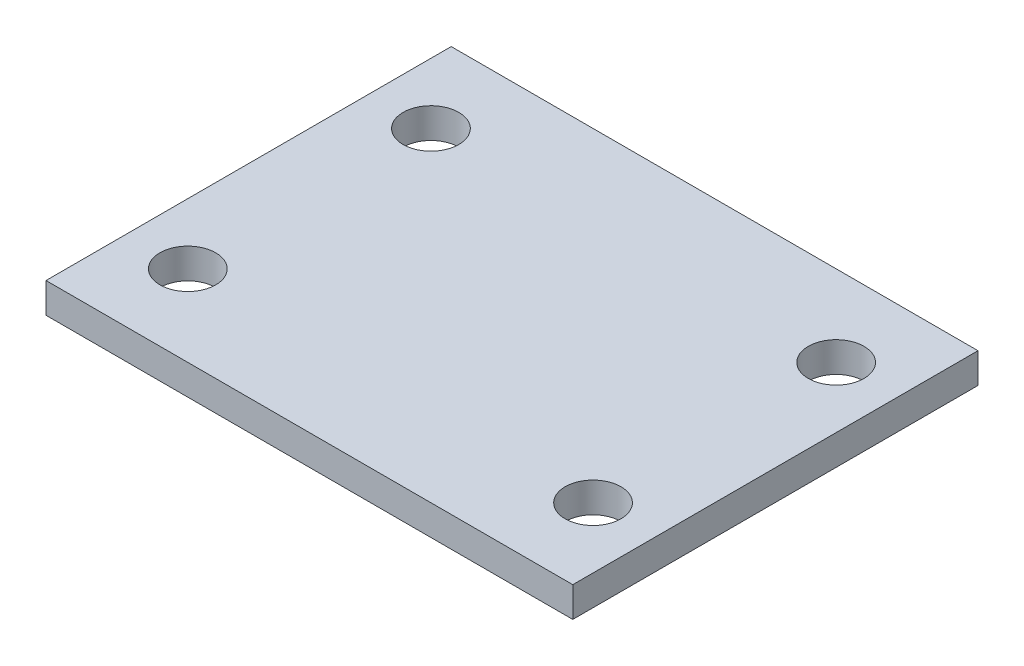
ISO-10303-21;
HEADER;
FILE_DESCRIPTION(('STEP AP214'),'2;1');
FILE_NAME('part.step','',(''),(''),'','','');
FILE_SCHEMA(('AUTOMOTIVE_DESIGN { 1 0 10303 214 1 1 1 1 }'));
ENDSEC;
DATA;
#1=APPLICATION_CONTEXT('core data for automotive mechanical design processes');
#2=APPLICATION_PROTOCOL_DEFINITION('international standard','automotive_design',2000,#1);
#3=PRODUCT_CONTEXT('',#1,'mechanical');
#4=PRODUCT('Part','Part','',(#3));
#5=PRODUCT_RELATED_PRODUCT_CATEGORY('part','',(#4));
#6=PRODUCT_DEFINITION_FORMATION('','',#4);
#7=PRODUCT_DEFINITION_CONTEXT('part definition',#1,'design');
#8=PRODUCT_DEFINITION('design','',#6,#7);
#9=PRODUCT_DEFINITION_SHAPE('','',#8);
#10=(LENGTH_UNIT() NAMED_UNIT(*) SI_UNIT(.MILLI.,.METRE.));
#11=(NAMED_UNIT(*) PLANE_ANGLE_UNIT() SI_UNIT($,.RADIAN.));
#12=(NAMED_UNIT(*) SI_UNIT($,.STERADIAN.) SOLID_ANGLE_UNIT());
#13=UNCERTAINTY_MEASURE_WITH_UNIT(LENGTH_MEASURE(1.E-05),#10,'distance_accuracy_value','');
#14=(GEOMETRIC_REPRESENTATION_CONTEXT(3) GLOBAL_UNCERTAINTY_ASSIGNED_CONTEXT((#13)) GLOBAL_UNIT_ASSIGNED_CONTEXT((#10,
#11,#12)) REPRESENTATION_CONTEXT('',''));
#15=CARTESIAN_POINT('',(0.,0.,0.));
#16=DIRECTION('',(0.,0.,1.));
#17=DIRECTION('',(1.,0.,0.));
#18=AXIS2_PLACEMENT_3D('',#15,#16,#17);
#19=CARTESIAN_POINT('',(25.999999943,2.97434,-20.000000005));
#20=DIRECTION('',(-1.,0.,0.));
#21=DIRECTION('',(0.,0.,1.));
#22=AXIS2_PLACEMENT_3D('',#19,#20,#21);
#23=PLANE('',#22);
#24=DIRECTION('',(0.,0.,-1.));
#25=VECTOR('',#24,1.);
#26=CARTESIAN_POINT('',(25.999999943,0.,-20.000000005));
#27=LINE('',#26,#25);
#28=CARTESIAN_POINT('',(25.999999943,0.,20.000000005));
#29=VERTEX_POINT('',#28);
#30=CARTESIAN_POINT('',(25.999999943,0.,-20.000000005));
#31=VERTEX_POINT('',#30);
#32=EDGE_CURVE('E97',#29,#31,#27,.T.);
#33=ORIENTED_EDGE('',*,*,#32,.T.);
#34=DIRECTION('',(0.,-1.,0.));
#35=VECTOR('',#34,1.);
#36=CARTESIAN_POINT('',(25.999999943,2.97434,-20.000000005));
#37=LINE('',#36,#35);
#38=CARTESIAN_POINT('',(25.999999943,2.97434,-20.000000005));
#39=VERTEX_POINT('',#38);
#40=EDGE_CURVE('E11',#39,#31,#37,.T.);
#41=ORIENTED_EDGE('',*,*,#40,.F.);
#42=DIRECTION('',(0.,0.,-1.));
#43=VECTOR('',#42,1.);
#44=CARTESIAN_POINT('',(25.999999943,2.97434,-20.000000005));
#45=LINE('',#44,#43);
#46=CARTESIAN_POINT('',(25.999999943,2.97434,20.000000005));
#47=VERTEX_POINT('',#46);
#48=EDGE_CURVE('E85',#47,#39,#45,.T.);
#49=ORIENTED_EDGE('',*,*,#48,.F.);
#50=DIRECTION('',(0.,-1.,0.));
#51=VECTOR('',#50,1.);
#52=CARTESIAN_POINT('',(25.999999943,2.97434,20.000000005));
#53=LINE('',#52,#51);
#54=EDGE_CURVE('E93',#47,#29,#53,.T.);
#55=ORIENTED_EDGE('',*,*,#54,.T.);
#56=EDGE_LOOP('',(#33,#41,#49,#55));
#57=FACE_BOUND('',#56,.T.);
#58=ADVANCED_FACE('F34',(#57),#23,.F.);
#59=CARTESIAN_POINT('',(-25.999999943,2.97434,-20.000000005));
#60=DIRECTION('',(0.,0.,1.));
#61=DIRECTION('',(1.,0.,0.));
#62=AXIS2_PLACEMENT_3D('',#59,#60,#61);
#63=PLANE('',#62);
#64=DIRECTION('',(-1.,0.,0.));
#65=VECTOR('',#64,1.);
#66=CARTESIAN_POINT('',(-25.999999943,0.,-20.000000005));
#67=LINE('',#66,#65);
#68=CARTESIAN_POINT('',(-25.999999943,0.,-20.000000005));
#69=VERTEX_POINT('',#68);
#70=EDGE_CURVE('E89',#31,#69,#67,.T.);
#71=ORIENTED_EDGE('',*,*,#70,.T.);
#72=DIRECTION('',(0.,-1.,0.));
#73=VECTOR('',#72,1.);
#74=CARTESIAN_POINT('',(-25.999999943,2.97434,-20.000000005));
#75=LINE('',#74,#73);
#76=CARTESIAN_POINT('',(-25.999999943,2.97434,-20.000000005));
#77=VERTEX_POINT('',#76);
#78=EDGE_CURVE('E42',#77,#69,#75,.T.);
#79=ORIENTED_EDGE('',*,*,#78,.F.);
#80=DIRECTION('',(-1.,0.,0.));
#81=VECTOR('',#80,1.);
#82=CARTESIAN_POINT('',(-25.999999943,2.97434,-20.000000005));
#83=LINE('',#82,#81);
#84=EDGE_CURVE('E80',#39,#77,#83,.T.);
#85=ORIENTED_EDGE('',*,*,#84,.F.);
#86=ORIENTED_EDGE('',*,*,#40,.T.);
#87=EDGE_LOOP('',(#71,#79,#85,#86));
#88=FACE_BOUND('',#87,.T.);
#89=ADVANCED_FACE('F88',(#88),#63,.F.);
#90=CARTESIAN_POINT('',(-25.999999943,2.97434,-20.000000005));
#91=DIRECTION('',(1.,0.,0.));
#92=DIRECTION('',(0.,0.,-1.));
#93=AXIS2_PLACEMENT_3D('',#90,#91,#92);
#94=PLANE('',#93);
#95=DIRECTION('',(0.,0.,1.));
#96=VECTOR('',#95,1.);
#97=CARTESIAN_POINT('',(-25.999999943,0.,-20.000000005));
#98=LINE('',#97,#96);
#99=CARTESIAN_POINT('',(-25.999999943,0.,20.000000005));
#100=VERTEX_POINT('',#99);
#101=EDGE_CURVE('E67',#69,#100,#98,.T.);
#102=ORIENTED_EDGE('',*,*,#101,.T.);
#103=DIRECTION('',(0.,-1.,0.));
#104=VECTOR('',#103,1.);
#105=CARTESIAN_POINT('',(-25.999999943,2.97434,20.000000005));
#106=LINE('',#105,#104);
#107=CARTESIAN_POINT('',(-25.999999943,2.97434,20.000000005));
#108=VERTEX_POINT('',#107);
#109=EDGE_CURVE('E90',#108,#100,#106,.T.);
#110=ORIENTED_EDGE('',*,*,#109,.F.);
#111=DIRECTION('',(0.,0.,1.));
#112=VECTOR('',#111,1.);
#113=CARTESIAN_POINT('',(-25.999999943,2.97434,-20.000000005));
#114=LINE('',#113,#112);
#115=EDGE_CURVE('E83',#77,#108,#114,.T.);
#116=ORIENTED_EDGE('',*,*,#115,.F.);
#117=ORIENTED_EDGE('',*,*,#78,.T.);
#118=EDGE_LOOP('',(#102,#110,#116,#117));
#119=FACE_BOUND('',#118,.T.);
#120=ADVANCED_FACE('F91',(#119),#94,.F.);
#121=CARTESIAN_POINT('',(-25.999999943,2.97434,20.000000005));
#122=DIRECTION('',(0.,0.,-1.));
#123=DIRECTION('',(-1.,0.,0.));
#124=AXIS2_PLACEMENT_3D('',#121,#122,#123);
#125=PLANE('',#124);
#126=DIRECTION('',(1.,0.,0.));
#127=VECTOR('',#126,1.);
#128=CARTESIAN_POINT('',(-25.999999943,0.,20.000000005));
#129=LINE('',#128,#127);
#130=EDGE_CURVE('E73',#100,#29,#129,.T.);
#131=ORIENTED_EDGE('',*,*,#130,.T.);
#132=ORIENTED_EDGE('',*,*,#54,.F.);
#133=DIRECTION('',(1.,0.,0.));
#134=VECTOR('',#133,1.);
#135=CARTESIAN_POINT('',(-25.999999943,2.97434,20.000000005));
#136=LINE('',#135,#134);
#137=EDGE_CURVE('E50',#108,#47,#136,.T.);
#138=ORIENTED_EDGE('',*,*,#137,.F.);
#139=ORIENTED_EDGE('',*,*,#109,.T.);
#140=EDGE_LOOP('',(#131,#132,#138,#139));
#141=FACE_BOUND('',#140,.T.);
#142=ADVANCED_FACE('F105',(#141),#125,.F.);
#143=CARTESIAN_POINT('',(0.,2.97434,0.));
#144=DIRECTION('',(0.,1.,0.));
#145=DIRECTION('',(0.,0.,1.));
#146=AXIS2_PLACEMENT_3D('',#143,#144,#145);
#147=PLANE('',#146);
#148=CARTESIAN_POINT('',(20.,2.97434,-12.));
#149=DIRECTION('',(0.,-1.,0.));
#150=DIRECTION('',(0.,0.,-1.));
#151=AXIS2_PLACEMENT_3D('',#148,#149,#150);
#152=CIRCLE('',#151,2.75);
#153=CARTESIAN_POINT('',(20.,2.97434,-14.75));
#154=VERTEX_POINT('',#153);
#155=EDGE_CURVE('E128',#154,#154,#152,.T.);
#156=ORIENTED_EDGE('',*,*,#155,.T.);
#157=EDGE_LOOP('',(#156));
#158=FACE_BOUND('',#157,.T.);
#159=CARTESIAN_POINT('',(-20.,2.97434,-12.));
#160=DIRECTION('',(0.,-1.,0.));
#161=DIRECTION('',(0.,0.,-1.));
#162=AXIS2_PLACEMENT_3D('',#159,#160,#161);
#163=CIRCLE('',#162,2.75);
#164=CARTESIAN_POINT('',(-20.,2.97434,-14.75));
#165=VERTEX_POINT('',#164);
#166=EDGE_CURVE('E122',#165,#165,#163,.T.);
#167=ORIENTED_EDGE('',*,*,#166,.T.);
#168=EDGE_LOOP('',(#167));
#169=FACE_BOUND('',#168,.T.);
#170=CARTESIAN_POINT('',(-20.,2.97434,12.));
#171=DIRECTION('',(0.,-1.,0.));
#172=DIRECTION('',(0.,0.,-1.));
#173=AXIS2_PLACEMENT_3D('',#170,#171,#172);
#174=CIRCLE('',#173,2.75);
#175=CARTESIAN_POINT('',(-20.,2.97434,9.25));
#176=VERTEX_POINT('',#175);
#177=EDGE_CURVE('E116',#176,#176,#174,.T.);
#178=ORIENTED_EDGE('',*,*,#177,.T.);
#179=EDGE_LOOP('',(#178));
#180=FACE_BOUND('',#179,.T.);
#181=CARTESIAN_POINT('',(20.,2.97434,12.));
#182=DIRECTION('',(0.,-1.,0.));
#183=DIRECTION('',(0.,0.,-1.));
#184=AXIS2_PLACEMENT_3D('',#181,#182,#183);
#185=CIRCLE('',#184,2.75);
#186=CARTESIAN_POINT('',(20.,2.97434,9.24999999999999));
#187=VERTEX_POINT('',#186);
#188=EDGE_CURVE('E100',#187,#187,#185,.T.);
#189=ORIENTED_EDGE('',*,*,#188,.T.);
#190=EDGE_LOOP('',(#189));
#191=FACE_BOUND('',#190,.T.);
#192=ORIENTED_EDGE('',*,*,#48,.T.);
#193=ORIENTED_EDGE('',*,*,#84,.T.);
#194=ORIENTED_EDGE('',*,*,#115,.T.);
#195=ORIENTED_EDGE('',*,*,#137,.T.);
#196=EDGE_LOOP('',(#192,#193,#194,#195));
#197=FACE_BOUND('',#196,.T.);
#198=ADVANCED_FACE('F81',(#158,#169,#180,#191,#197),#147,.T.);
#199=CARTESIAN_POINT('',(0.,0.,0.));
#200=DIRECTION('',(0.,1.,0.));
#201=DIRECTION('',(0.,0.,1.));
#202=AXIS2_PLACEMENT_3D('',#199,#200,#201);
#203=PLANE('',#202);
#204=CARTESIAN_POINT('',(20.,0.,-12.));
#205=DIRECTION('',(0.,-1.,0.));
#206=DIRECTION('',(0.,0.,-1.));
#207=AXIS2_PLACEMENT_3D('',#204,#205,#206);
#208=CIRCLE('',#207,2.75);
#209=CARTESIAN_POINT('',(20.,0.,-14.75));
#210=VERTEX_POINT('',#209);
#211=EDGE_CURVE('E131',#210,#210,#208,.T.);
#212=ORIENTED_EDGE('',*,*,#211,.F.);
#213=EDGE_LOOP('',(#212));
#214=FACE_BOUND('',#213,.T.);
#215=CARTESIAN_POINT('',(-20.,0.,-12.));
#216=DIRECTION('',(0.,-1.,0.));
#217=DIRECTION('',(0.,0.,-1.));
#218=AXIS2_PLACEMENT_3D('',#215,#216,#217);
#219=CIRCLE('',#218,2.75);
#220=CARTESIAN_POINT('',(-20.,0.,-14.75));
#221=VERTEX_POINT('',#220);
#222=EDGE_CURVE('E125',#221,#221,#219,.T.);
#223=ORIENTED_EDGE('',*,*,#222,.F.);
#224=EDGE_LOOP('',(#223));
#225=FACE_BOUND('',#224,.T.);
#226=CARTESIAN_POINT('',(-20.,0.,12.));
#227=DIRECTION('',(0.,-1.,0.));
#228=DIRECTION('',(0.,0.,-1.));
#229=AXIS2_PLACEMENT_3D('',#226,#227,#228);
#230=CIRCLE('',#229,2.75);
#231=CARTESIAN_POINT('',(-20.,0.,9.25));
#232=VERTEX_POINT('',#231);
#233=EDGE_CURVE('E119',#232,#232,#230,.T.);
#234=ORIENTED_EDGE('',*,*,#233,.F.);
#235=EDGE_LOOP('',(#234));
#236=FACE_BOUND('',#235,.T.);
#237=CARTESIAN_POINT('',(20.,0.,12.));
#238=DIRECTION('',(0.,-1.,0.));
#239=DIRECTION('',(0.,0.,-1.));
#240=AXIS2_PLACEMENT_3D('',#237,#238,#239);
#241=CIRCLE('',#240,2.75);
#242=CARTESIAN_POINT('',(20.,0.,9.24999999999999));
#243=VERTEX_POINT('',#242);
#244=EDGE_CURVE('E113',#243,#243,#241,.T.);
#245=ORIENTED_EDGE('',*,*,#244,.F.);
#246=EDGE_LOOP('',(#245));
#247=FACE_BOUND('',#246,.T.);
#248=ORIENTED_EDGE('',*,*,#32,.F.);
#249=ORIENTED_EDGE('',*,*,#130,.F.);
#250=ORIENTED_EDGE('',*,*,#101,.F.);
#251=ORIENTED_EDGE('',*,*,#70,.F.);
#252=EDGE_LOOP('',(#248,#249,#250,#251));
#253=FACE_BOUND('',#252,.T.);
#254=ADVANCED_FACE('F108',(#214,#225,#236,#247,#253),#203,.F.);
#255=CARTESIAN_POINT('',(20.,0.,12.));
#256=DIRECTION('',(0.,-1.,0.));
#257=DIRECTION('',(0.,0.,-1.));
#258=AXIS2_PLACEMENT_3D('',#255,#256,#257);
#259=CYLINDRICAL_SURFACE('',#258,2.75);
#260=ORIENTED_EDGE('',*,*,#188,.F.);
#261=EDGE_LOOP('',(#260));
#262=FACE_BOUND('',#261,.T.);
#263=ORIENTED_EDGE('',*,*,#244,.T.);
#264=EDGE_LOOP('',(#263));
#265=FACE_BOUND('',#264,.T.);
#266=ADVANCED_FACE('F139',(#262,#265),#259,.F.);
#267=CARTESIAN_POINT('',(-20.,0.,12.));
#268=DIRECTION('',(0.,-1.,0.));
#269=DIRECTION('',(0.,0.,-1.));
#270=AXIS2_PLACEMENT_3D('',#267,#268,#269);
#271=CYLINDRICAL_SURFACE('',#270,2.75);
#272=ORIENTED_EDGE('',*,*,#177,.F.);
#273=EDGE_LOOP('',(#272));
#274=FACE_BOUND('',#273,.T.);
#275=ORIENTED_EDGE('',*,*,#233,.T.);
#276=EDGE_LOOP('',(#275));
#277=FACE_BOUND('',#276,.T.);
#278=ADVANCED_FACE('F148',(#274,#277),#271,.F.);
#279=CARTESIAN_POINT('',(-20.,0.,-12.));
#280=DIRECTION('',(0.,-1.,0.));
#281=DIRECTION('',(0.,0.,-1.));
#282=AXIS2_PLACEMENT_3D('',#279,#280,#281);
#283=CYLINDRICAL_SURFACE('',#282,2.75);
#284=ORIENTED_EDGE('',*,*,#166,.F.);
#285=EDGE_LOOP('',(#284));
#286=FACE_BOUND('',#285,.T.);
#287=ORIENTED_EDGE('',*,*,#222,.T.);
#288=EDGE_LOOP('',(#287));
#289=FACE_BOUND('',#288,.T.);
#290=ADVANCED_FACE('F154',(#286,#289),#283,.F.);
#291=CARTESIAN_POINT('',(20.,0.,-12.));
#292=DIRECTION('',(0.,-1.,0.));
#293=DIRECTION('',(0.,0.,-1.));
#294=AXIS2_PLACEMENT_3D('',#291,#292,#293);
#295=CYLINDRICAL_SURFACE('',#294,2.75);
#296=ORIENTED_EDGE('',*,*,#155,.F.);
#297=EDGE_LOOP('',(#296));
#298=FACE_BOUND('',#297,.T.);
#299=ORIENTED_EDGE('',*,*,#211,.T.);
#300=EDGE_LOOP('',(#299));
#301=FACE_BOUND('',#300,.T.);
#302=ADVANCED_FACE('F135',(#298,#301),#295,.F.);
#303=CLOSED_SHELL('',(#58,#89,#120,#142,#198,#254,#266,#278,#290,#302));
#304=MANIFOLD_SOLID_BREP('B2',#303);
#305=ADVANCED_BREP_SHAPE_REPRESENTATION('',(#18,#304),#14);
#306=SHAPE_DEFINITION_REPRESENTATION(#9,#305);
ENDSEC;
END-ISO-10303-21;
